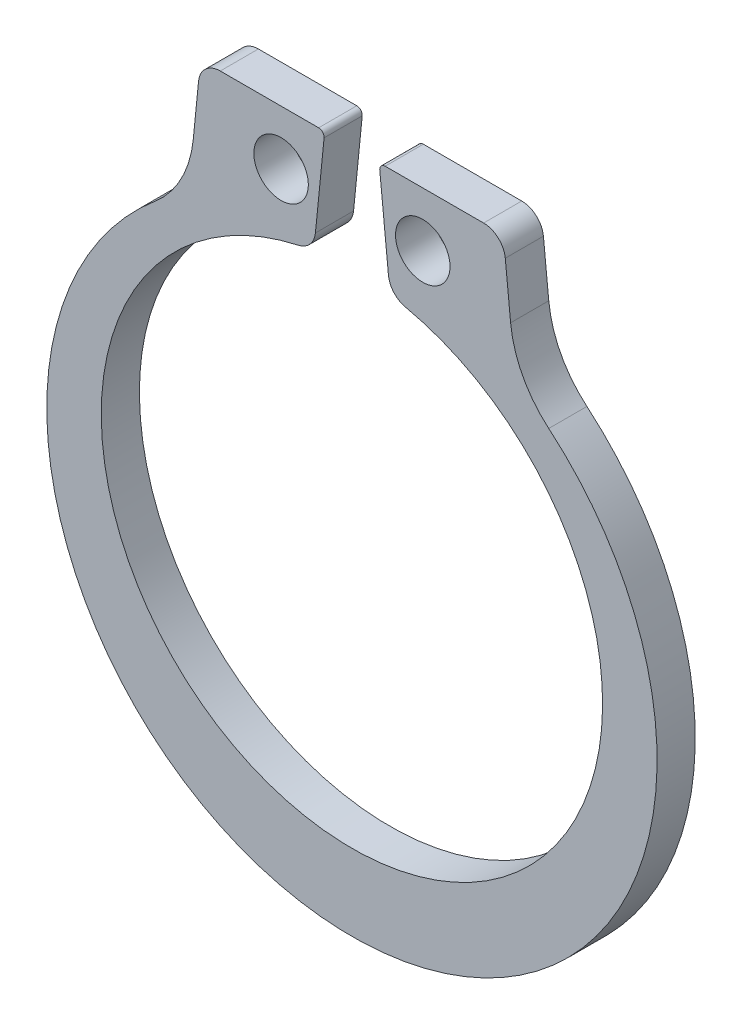
ISO-10303-21;
HEADER;
FILE_DESCRIPTION(('STEP AP214'),'2;1');
FILE_NAME('part.step','',(''),(''),'','','');
FILE_SCHEMA(('AUTOMOTIVE_DESIGN { 1 0 10303 214 1 1 1 1 }'));
ENDSEC;
DATA;
#1=APPLICATION_CONTEXT('core data for automotive mechanical design processes');
#2=APPLICATION_PROTOCOL_DEFINITION('international standard','automotive_design',2000,#1);
#3=PRODUCT_CONTEXT('',#1,'mechanical');
#4=PRODUCT('Part','Part','',(#3));
#5=PRODUCT_RELATED_PRODUCT_CATEGORY('part','',(#4));
#6=PRODUCT_DEFINITION_FORMATION('','',#4);
#7=PRODUCT_DEFINITION_CONTEXT('part definition',#1,'design');
#8=PRODUCT_DEFINITION('design','',#6,#7);
#9=PRODUCT_DEFINITION_SHAPE('','',#8);
#10=(LENGTH_UNIT() NAMED_UNIT(*) SI_UNIT(.MILLI.,.METRE.));
#11=(NAMED_UNIT(*) PLANE_ANGLE_UNIT() SI_UNIT($,.RADIAN.));
#12=(NAMED_UNIT(*) SI_UNIT($,.STERADIAN.) SOLID_ANGLE_UNIT());
#13=UNCERTAINTY_MEASURE_WITH_UNIT(LENGTH_MEASURE(1.E-05),#10,'distance_accuracy_value','');
#14=(GEOMETRIC_REPRESENTATION_CONTEXT(3) GLOBAL_UNCERTAINTY_ASSIGNED_CONTEXT((#13)) GLOBAL_UNIT_ASSIGNED_CONTEXT((#10,
#11,#12)) REPRESENTATION_CONTEXT('',''));
#15=CARTESIAN_POINT('',(0.,0.,0.));
#16=DIRECTION('',(0.,0.,1.));
#17=DIRECTION('',(1.,0.,0.));
#18=AXIS2_PLACEMENT_3D('',#15,#16,#17);
#19=CARTESIAN_POINT('',(6.22562320773473,6.86781993240851,0.889));
#20=DIRECTION('',(0.,0.,-1.));
#21=DIRECTION('',(-1.,0.,0.));
#22=AXIS2_PLACEMENT_3D('',#19,#20,#21);
#23=PLANE('',#22);
#24=CARTESIAN_POINT('',(6.22562320773473,6.86781993240851,0.889));
#25=DIRECTION('',(0.,0.,-1.));
#26=DIRECTION('',(-1.,0.,0.));
#27=AXIS2_PLACEMENT_3D('',#24,#25,#26);
#28=CIRCLE('',#27,2.54);
#29=CARTESIAN_POINT('',(4.58730131096243,4.92681468703785,0.889));
#30=VERTEX_POINT('',#29);
#31=CARTESIAN_POINT('',(3.69822874460136,6.61508048609518,0.889));
#32=VERTEX_POINT('',#31);
#33=EDGE_CURVE('E208',#30,#32,#28,.T.);
#34=ORIENTED_EDGE('',*,*,#33,.T.);
#35=DIRECTION('',(-0.0995037190209991,0.995037190209989,0.));
#36=VECTOR('',#35,1.);
#37=CARTESIAN_POINT('',(3.69822874460136,6.61508048609518,0.889));
#38=LINE('',#37,#36);
#39=CARTESIAN_POINT('',(3.57408575386381,7.85651039347067,0.889));
#40=VERTEX_POINT('',#39);
#41=EDGE_CURVE('E116',#32,#40,#38,.T.);
#42=ORIENTED_EDGE('',*,*,#41,.T.);
#43=CARTESIAN_POINT('',(3.06860686123713,7.80596250420801,0.889));
#44=DIRECTION('',(0.,0.,1.));
#45=DIRECTION('',(-1.,0.,0.));
#46=AXIS2_PLACEMENT_3D('',#43,#44,#45);
#47=CIRCLE('',#46,0.508);
#48=CARTESIAN_POINT('',(3.06860686123713,8.31396250420801,0.889));
#49=VERTEX_POINT('',#48);
#50=EDGE_CURVE('E247',#40,#49,#47,.T.);
#51=ORIENTED_EDGE('',*,*,#50,.T.);
#52=DIRECTION('',(-1.,0.,0.));
#53=VECTOR('',#52,1.);
#54=CARTESIAN_POINT('',(3.06860686123713,8.31396250420801,0.889));
#55=LINE('',#54,#53);
#56=CARTESIAN_POINT('',(0.775333420388236,8.31396250420801,0.889));
#57=VERTEX_POINT('',#56);
#58=EDGE_CURVE('E266',#49,#57,#55,.T.);
#59=ORIENTED_EDGE('',*,*,#58,.T.);
#60=CARTESIAN_POINT('',(0.775333420388235,8.18696250420801,0.889));
#61=DIRECTION('',(0.,0.,1.));
#62=DIRECTION('',(1.,0.,0.));
#63=AXIS2_PLACEMENT_3D('',#60,#61,#62);
#64=CIRCLE('',#63,0.127);
#65=CARTESIAN_POINT('',(0.648963697231567,8.17432553189234,0.889));
#66=VERTEX_POINT('',#65);
#67=EDGE_CURVE('E263',#57,#66,#64,.T.);
#68=ORIENTED_EDGE('',*,*,#67,.T.);
#69=DIRECTION('',(0.0995037190209989,-0.995037190209989,0.));
#70=VECTOR('',#69,1.);
#71=CARTESIAN_POINT('',(0.648963697231567,8.17432553189234,0.889));
#72=LINE('',#71,#70);
#73=CARTESIAN_POINT('',(0.851111103650512,6.15285146770289,0.889));
#74=VERTEX_POINT('',#73);
#75=EDGE_CURVE('E265',#66,#74,#72,.T.);
#76=ORIENTED_EDGE('',*,*,#75,.T.);
#77=CARTESIAN_POINT('',(1.35658999627719,6.20339935696556,0.889));
#78=DIRECTION('',(0.,0.,1.));
#79=DIRECTION('',(1.,0.,0.));
#80=AXIS2_PLACEMENT_3D('',#77,#78,#79);
#81=CIRCLE('',#80,0.508);
#82=CARTESIAN_POINT('',(1.24806279657501,5.70712740840831,0.889));
#83=VERTEX_POINT('',#82);
#84=EDGE_CURVE('E268',#74,#83,#81,.T.);
#85=ORIENTED_EDGE('',*,*,#84,.T.);
#86=CARTESIAN_POINT('',(0.,0.,0.889));
#87=DIRECTION('',(0.,0.,-1.));
#88=DIRECTION('',(1.,0.,0.));
#89=AXIS2_PLACEMENT_3D('',#86,#87,#88);
#90=CIRCLE('',#89,5.842);
#91=CARTESIAN_POINT('',(-1.24806279657501,5.70712740840831,0.889));
#92=VERTEX_POINT('',#91);
#93=EDGE_CURVE('E274',#83,#92,#90,.T.);
#94=ORIENTED_EDGE('',*,*,#93,.T.);
#95=CARTESIAN_POINT('',(-1.35658999627719,6.20339935696556,0.889));
#96=DIRECTION('',(0.,0.,1.));
#97=DIRECTION('',(-1.,0.,0.));
#98=AXIS2_PLACEMENT_3D('',#95,#96,#97);
#99=CIRCLE('',#98,0.508);
#100=CARTESIAN_POINT('',(-0.851111103650512,6.15285146770289,0.889));
#101=VERTEX_POINT('',#100);
#102=EDGE_CURVE('E276',#92,#101,#99,.T.);
#103=ORIENTED_EDGE('',*,*,#102,.T.);
#104=DIRECTION('',(0.0995037190209989,0.995037190209989,0.));
#105=VECTOR('',#104,1.);
#106=CARTESIAN_POINT('',(-0.648963697231567,8.17432553189234,0.889));
#107=LINE('',#106,#105);
#108=CARTESIAN_POINT('',(-0.648963697231567,8.17432553189234,0.889));
#109=VERTEX_POINT('',#108);
#110=EDGE_CURVE('E278',#101,#109,#107,.T.);
#111=ORIENTED_EDGE('',*,*,#110,.T.);
#112=CARTESIAN_POINT('',(-0.775333420388235,8.18696250420801,0.889));
#113=DIRECTION('',(0.,0.,1.));
#114=DIRECTION('',(-1.,0.,0.));
#115=AXIS2_PLACEMENT_3D('',#112,#113,#114);
#116=CIRCLE('',#115,0.127);
#117=CARTESIAN_POINT('',(-0.775333420388236,8.31396250420801,0.889));
#118=VERTEX_POINT('',#117);
#119=EDGE_CURVE('E280',#109,#118,#116,.T.);
#120=ORIENTED_EDGE('',*,*,#119,.T.);
#121=DIRECTION('',(-1.,0.,0.));
#122=VECTOR('',#121,1.);
#123=CARTESIAN_POINT('',(-3.06860686123713,8.31396250420801,0.889));
#124=LINE('',#123,#122);
#125=CARTESIAN_POINT('',(-3.06860686123713,8.31396250420801,0.889));
#126=VERTEX_POINT('',#125);
#127=EDGE_CURVE('E282',#118,#126,#124,.T.);
#128=ORIENTED_EDGE('',*,*,#127,.T.);
#129=CARTESIAN_POINT('',(-3.06860686123713,7.80596250420801,0.889));
#130=DIRECTION('',(0.,0.,1.));
#131=DIRECTION('',(1.,0.,0.));
#132=AXIS2_PLACEMENT_3D('',#129,#130,#131);
#133=CIRCLE('',#132,0.508);
#134=CARTESIAN_POINT('',(-3.57408575386381,7.85651039347067,0.889));
#135=VERTEX_POINT('',#134);
#136=EDGE_CURVE('E159',#126,#135,#133,.T.);
#137=ORIENTED_EDGE('',*,*,#136,.T.);
#138=DIRECTION('',(-0.0995037190209988,-0.995037190209989,0.));
#139=VECTOR('',#138,1.);
#140=CARTESIAN_POINT('',(-3.69822874460136,6.61508048609518,0.889));
#141=LINE('',#140,#139);
#142=CARTESIAN_POINT('',(-3.69822874460136,6.61508048609518,0.889));
#143=VERTEX_POINT('',#142);
#144=EDGE_CURVE('E153',#135,#143,#141,.T.);
#145=ORIENTED_EDGE('',*,*,#144,.T.);
#146=CARTESIAN_POINT('',(-6.22562320773473,6.86781993240851,0.889));
#147=DIRECTION('',(0.,0.,-1.));
#148=DIRECTION('',(1.,0.,0.));
#149=AXIS2_PLACEMENT_3D('',#146,#147,#148);
#150=CIRCLE('',#149,2.54);
#151=CARTESIAN_POINT('',(-4.58730131096243,4.92681468703785,0.889));
#152=VERTEX_POINT('',#151);
#153=EDGE_CURVE('E157',#143,#152,#150,.T.);
#154=ORIENTED_EDGE('',*,*,#153,.T.);
#155=CARTESIAN_POINT('',(0.,-0.508,0.889));
#156=DIRECTION('',(0.,0.,1.));
#157=DIRECTION('',(1.,0.,0.));
#158=AXIS2_PLACEMENT_3D('',#155,#156,#157);
#159=CIRCLE('',#158,7.112);
#160=EDGE_CURVE('E49',#152,#30,#159,.T.);
#161=ORIENTED_EDGE('',*,*,#160,.T.);
#162=EDGE_LOOP('',(#34,#42,#51,#59,#68,#76,#85,#94,#103,#111,#120,#128,#137,#145,#154,#161));
#163=FACE_BOUND('',#162,.T.);
#164=CARTESIAN_POINT('',(-1.651,7.04396250420801,0.889));
#165=DIRECTION('',(0.,0.,1.));
#166=DIRECTION('',(1.,0.,0.));
#167=AXIS2_PLACEMENT_3D('',#164,#165,#166);
#168=CIRCLE('',#167,0.635);
#169=CARTESIAN_POINT('',(-1.016,7.04396250420801,0.889));
#170=VERTEX_POINT('',#169);
#171=EDGE_CURVE('E181',#170,#170,#168,.T.);
#172=ORIENTED_EDGE('',*,*,#171,.F.);
#173=EDGE_LOOP('',(#172));
#174=FACE_BOUND('',#173,.T.);
#175=CARTESIAN_POINT('',(1.651,7.04396250420801,0.889));
#176=DIRECTION('',(0.,0.,1.));
#177=DIRECTION('',(1.,0.,0.));
#178=AXIS2_PLACEMENT_3D('',#175,#176,#177);
#179=CIRCLE('',#178,0.635);
#180=CARTESIAN_POINT('',(2.286,7.04396250420801,0.889));
#181=VERTEX_POINT('',#180);
#182=EDGE_CURVE('E323',#181,#181,#179,.T.);
#183=ORIENTED_EDGE('',*,*,#182,.F.);
#184=EDGE_LOOP('',(#183));
#185=FACE_BOUND('',#184,.T.);
#186=ADVANCED_FACE('F32',(#163,#174,#185),#23,.F.);
#187=CARTESIAN_POINT('',(6.22562320773473,6.86781993240851,0.));
#188=DIRECTION('',(0.,0.,-1.));
#189=DIRECTION('',(-1.,0.,0.));
#190=AXIS2_PLACEMENT_3D('',#187,#188,#189);
#191=PLANE('',#190);
#192=CARTESIAN_POINT('',(-1.651,7.04396250420801,0.));
#193=DIRECTION('',(0.,0.,1.));
#194=DIRECTION('',(1.,0.,0.));
#195=AXIS2_PLACEMENT_3D('',#192,#193,#194);
#196=CIRCLE('',#195,0.635);
#197=CARTESIAN_POINT('',(-1.016,7.04396250420801,0.));
#198=VERTEX_POINT('',#197);
#199=EDGE_CURVE('E328',#198,#198,#196,.T.);
#200=ORIENTED_EDGE('',*,*,#199,.T.);
#201=EDGE_LOOP('',(#200));
#202=FACE_BOUND('',#201,.T.);
#203=CARTESIAN_POINT('',(6.22562320773473,6.86781993240851,0.));
#204=DIRECTION('',(0.,0.,-1.));
#205=DIRECTION('',(-1.,0.,0.));
#206=AXIS2_PLACEMENT_3D('',#203,#204,#205);
#207=CIRCLE('',#206,2.54);
#208=CARTESIAN_POINT('',(4.58730131096243,4.92681468703785,0.));
#209=VERTEX_POINT('',#208);
#210=CARTESIAN_POINT('',(3.69822874460136,6.61508048609518,0.));
#211=VERTEX_POINT('',#210);
#212=EDGE_CURVE('E177',#209,#211,#207,.T.);
#213=ORIENTED_EDGE('',*,*,#212,.F.);
#214=CARTESIAN_POINT('',(0.,-0.508,0.));
#215=DIRECTION('',(0.,0.,1.));
#216=DIRECTION('',(1.,0.,0.));
#217=AXIS2_PLACEMENT_3D('',#214,#215,#216);
#218=CIRCLE('',#217,7.112);
#219=CARTESIAN_POINT('',(-4.58730131096243,4.92681468703785,0.));
#220=VERTEX_POINT('',#219);
#221=EDGE_CURVE('E108',#220,#209,#218,.T.);
#222=ORIENTED_EDGE('',*,*,#221,.F.);
#223=CARTESIAN_POINT('',(-6.22562320773473,6.86781993240851,0.));
#224=DIRECTION('',(0.,0.,-1.));
#225=DIRECTION('',(1.,0.,0.));
#226=AXIS2_PLACEMENT_3D('',#223,#224,#225);
#227=CIRCLE('',#226,2.54);
#228=CARTESIAN_POINT('',(-3.69822874460136,6.61508048609518,0.));
#229=VERTEX_POINT('',#228);
#230=EDGE_CURVE('E102',#229,#220,#227,.T.);
#231=ORIENTED_EDGE('',*,*,#230,.F.);
#232=DIRECTION('',(-0.0995037190209988,-0.995037190209989,0.));
#233=VECTOR('',#232,1.);
#234=CARTESIAN_POINT('',(-3.69822874460136,6.61508048609518,0.));
#235=LINE('',#234,#233);
#236=CARTESIAN_POINT('',(-3.57408575386381,7.85651039347067,0.));
#237=VERTEX_POINT('',#236);
#238=EDGE_CURVE('E167',#237,#229,#235,.T.);
#239=ORIENTED_EDGE('',*,*,#238,.F.);
#240=CARTESIAN_POINT('',(-3.06860686123713,7.80596250420801,0.));
#241=DIRECTION('',(0.,0.,1.));
#242=DIRECTION('',(1.,0.,0.));
#243=AXIS2_PLACEMENT_3D('',#240,#241,#242);
#244=CIRCLE('',#243,0.508);
#245=CARTESIAN_POINT('',(-3.06860686123713,8.31396250420801,0.));
#246=VERTEX_POINT('',#245);
#247=EDGE_CURVE('E203',#246,#237,#244,.T.);
#248=ORIENTED_EDGE('',*,*,#247,.F.);
#249=DIRECTION('',(-1.,0.,0.));
#250=VECTOR('',#249,1.);
#251=CARTESIAN_POINT('',(-3.06860686123713,8.31396250420801,0.));
#252=LINE('',#251,#250);
#253=CARTESIAN_POINT('',(-0.775333420388236,8.31396250420801,0.));
#254=VERTEX_POINT('',#253);
#255=EDGE_CURVE('E201',#254,#246,#252,.T.);
#256=ORIENTED_EDGE('',*,*,#255,.F.);
#257=CARTESIAN_POINT('',(-0.775333420388235,8.18696250420801,0.));
#258=DIRECTION('',(0.,0.,1.));
#259=DIRECTION('',(-1.,0.,0.));
#260=AXIS2_PLACEMENT_3D('',#257,#258,#259);
#261=CIRCLE('',#260,0.127);
#262=CARTESIAN_POINT('',(-0.648963697231567,8.17432553189234,0.));
#263=VERTEX_POINT('',#262);
#264=EDGE_CURVE('E199',#263,#254,#261,.T.);
#265=ORIENTED_EDGE('',*,*,#264,.F.);
#266=DIRECTION('',(0.0995037190209989,0.995037190209989,0.));
#267=VECTOR('',#266,1.);
#268=CARTESIAN_POINT('',(-0.648963697231567,8.17432553189234,0.));
#269=LINE('',#268,#267);
#270=CARTESIAN_POINT('',(-0.851111103650512,6.15285146770289,0.));
#271=VERTEX_POINT('',#270);
#272=EDGE_CURVE('E197',#271,#263,#269,.T.);
#273=ORIENTED_EDGE('',*,*,#272,.F.);
#274=CARTESIAN_POINT('',(-1.35658999627719,6.20339935696556,0.));
#275=DIRECTION('',(0.,0.,1.));
#276=DIRECTION('',(-1.,0.,0.));
#277=AXIS2_PLACEMENT_3D('',#274,#275,#276);
#278=CIRCLE('',#277,0.508);
#279=CARTESIAN_POINT('',(-1.24806279657501,5.70712740840831,0.));
#280=VERTEX_POINT('',#279);
#281=EDGE_CURVE('E195',#280,#271,#278,.T.);
#282=ORIENTED_EDGE('',*,*,#281,.F.);
#283=CARTESIAN_POINT('',(0.,0.,0.));
#284=DIRECTION('',(0.,0.,-1.));
#285=DIRECTION('',(1.,0.,0.));
#286=AXIS2_PLACEMENT_3D('',#283,#284,#285);
#287=CIRCLE('',#286,5.842);
#288=CARTESIAN_POINT('',(1.24806279657501,5.70712740840831,0.));
#289=VERTEX_POINT('',#288);
#290=EDGE_CURVE('E193',#289,#280,#287,.T.);
#291=ORIENTED_EDGE('',*,*,#290,.F.);
#292=CARTESIAN_POINT('',(1.35658999627719,6.20339935696556,0.));
#293=DIRECTION('',(0.,0.,1.));
#294=DIRECTION('',(1.,0.,0.));
#295=AXIS2_PLACEMENT_3D('',#292,#293,#294);
#296=CIRCLE('',#295,0.508);
#297=CARTESIAN_POINT('',(0.851111103650512,6.15285146770289,0.));
#298=VERTEX_POINT('',#297);
#299=EDGE_CURVE('E191',#298,#289,#296,.T.);
#300=ORIENTED_EDGE('',*,*,#299,.F.);
#301=DIRECTION('',(0.0995037190209989,-0.995037190209989,0.));
#302=VECTOR('',#301,1.);
#303=CARTESIAN_POINT('',(0.648963697231567,8.17432553189234,0.));
#304=LINE('',#303,#302);
#305=CARTESIAN_POINT('',(0.648963697231567,8.17432553189234,0.));
#306=VERTEX_POINT('',#305);
#307=EDGE_CURVE('E189',#306,#298,#304,.T.);
#308=ORIENTED_EDGE('',*,*,#307,.F.);
#309=CARTESIAN_POINT('',(0.775333420388235,8.18696250420801,0.));
#310=DIRECTION('',(0.,0.,1.));
#311=DIRECTION('',(1.,0.,0.));
#312=AXIS2_PLACEMENT_3D('',#309,#310,#311);
#313=CIRCLE('',#312,0.127);
#314=CARTESIAN_POINT('',(0.775333420388236,8.31396250420801,0.));
#315=VERTEX_POINT('',#314);
#316=EDGE_CURVE('E187',#315,#306,#313,.T.);
#317=ORIENTED_EDGE('',*,*,#316,.F.);
#318=DIRECTION('',(-1.,0.,0.));
#319=VECTOR('',#318,1.);
#320=CARTESIAN_POINT('',(3.06860686123713,8.31396250420801,0.));
#321=LINE('',#320,#319);
#322=CARTESIAN_POINT('',(3.06860686123713,8.31396250420801,0.));
#323=VERTEX_POINT('',#322);
#324=EDGE_CURVE('E185',#323,#315,#321,.T.);
#325=ORIENTED_EDGE('',*,*,#324,.F.);
#326=CARTESIAN_POINT('',(3.06860686123713,7.80596250420801,0.));
#327=DIRECTION('',(0.,0.,1.));
#328=DIRECTION('',(-1.,0.,0.));
#329=AXIS2_PLACEMENT_3D('',#326,#327,#328);
#330=CIRCLE('',#329,0.508);
#331=CARTESIAN_POINT('',(3.57408575386381,7.85651039347067,0.));
#332=VERTEX_POINT('',#331);
#333=EDGE_CURVE('E183',#332,#323,#330,.T.);
#334=ORIENTED_EDGE('',*,*,#333,.F.);
#335=DIRECTION('',(-0.0995037190209991,0.995037190209989,0.));
#336=VECTOR('',#335,1.);
#337=CARTESIAN_POINT('',(3.69822874460136,6.61508048609518,0.));
#338=LINE('',#337,#336);
#339=EDGE_CURVE('E180',#211,#332,#338,.T.);
#340=ORIENTED_EDGE('',*,*,#339,.F.);
#341=EDGE_LOOP('',(#213,#222,#231,#239,#248,#256,#265,#273,#282,#291,#300,#308,#317,#325,#334,#340));
#342=FACE_BOUND('',#341,.T.);
#343=CARTESIAN_POINT('',(1.651,7.04396250420801,0.));
#344=DIRECTION('',(0.,0.,1.));
#345=DIRECTION('',(1.,0.,0.));
#346=AXIS2_PLACEMENT_3D('',#343,#344,#345);
#347=CIRCLE('',#346,0.635);
#348=CARTESIAN_POINT('',(2.286,7.04396250420801,0.));
#349=VERTEX_POINT('',#348);
#350=EDGE_CURVE('E326',#349,#349,#347,.T.);
#351=ORIENTED_EDGE('',*,*,#350,.T.);
#352=EDGE_LOOP('',(#351));
#353=FACE_BOUND('',#352,.T.);
#354=ADVANCED_FACE('F251',(#202,#342,#353),#191,.T.);
#355=CARTESIAN_POINT('',(6.22562320773473,6.86781993240851,0.889));
#356=DIRECTION('',(0.,0.,-1.));
#357=DIRECTION('',(-1.,0.,0.));
#358=AXIS2_PLACEMENT_3D('',#355,#356,#357);
#359=CYLINDRICAL_SURFACE('',#358,2.54);
#360=ORIENTED_EDGE('',*,*,#212,.T.);
#361=DIRECTION('',(0.,0.,-1.));
#362=VECTOR('',#361,1.);
#363=CARTESIAN_POINT('',(3.69822874460136,6.61508048609518,0.889));
#364=LINE('',#363,#362);
#365=EDGE_CURVE('E11',#32,#211,#364,.T.);
#366=ORIENTED_EDGE('',*,*,#365,.F.);
#367=ORIENTED_EDGE('',*,*,#33,.F.);
#368=DIRECTION('',(0.,0.,-1.));
#369=VECTOR('',#368,1.);
#370=CARTESIAN_POINT('',(4.58730131096243,4.92681468703785,0.889));
#371=LINE('',#370,#369);
#372=EDGE_CURVE('E173',#30,#209,#371,.T.);
#373=ORIENTED_EDGE('',*,*,#372,.T.);
#374=EDGE_LOOP('',(#360,#366,#367,#373));
#375=FACE_BOUND('',#374,.T.);
#376=ADVANCED_FACE('F34',(#375),#359,.F.);
#377=CARTESIAN_POINT('',(3.69822874460136,6.61508048609518,0.889));
#378=DIRECTION('',(-0.995037190209989,-0.0995037190209991,0.));
#379=DIRECTION('',(0.0995037190209991,-0.995037190209989,0.));
#380=AXIS2_PLACEMENT_3D('',#377,#378,#379);
#381=PLANE('',#380);
#382=ORIENTED_EDGE('',*,*,#339,.T.);
#383=DIRECTION('',(0.,0.,-1.));
#384=VECTOR('',#383,1.);
#385=CARTESIAN_POINT('',(3.57408575386381,7.85651039347067,0.889));
#386=LINE('',#385,#384);
#387=EDGE_CURVE('E41',#40,#332,#386,.T.);
#388=ORIENTED_EDGE('',*,*,#387,.F.);
#389=ORIENTED_EDGE('',*,*,#41,.F.);
#390=ORIENTED_EDGE('',*,*,#365,.T.);
#391=EDGE_LOOP('',(#382,#388,#389,#390));
#392=FACE_BOUND('',#391,.T.);
#393=ADVANCED_FACE('F463',(#392),#381,.F.);
#394=CARTESIAN_POINT('',(3.06860686123713,7.80596250420801,0.889));
#395=DIRECTION('',(0.,0.,-1.));
#396=DIRECTION('',(-1.,0.,0.));
#397=AXIS2_PLACEMENT_3D('',#394,#395,#396);
#398=CYLINDRICAL_SURFACE('',#397,0.508);
#399=ORIENTED_EDGE('',*,*,#333,.T.);
#400=DIRECTION('',(0.,0.,-1.));
#401=VECTOR('',#400,1.);
#402=CARTESIAN_POINT('',(3.06860686123713,8.31396250420801,0.889));
#403=LINE('',#402,#401);
#404=EDGE_CURVE('E239',#49,#323,#403,.T.);
#405=ORIENTED_EDGE('',*,*,#404,.F.);
#406=ORIENTED_EDGE('',*,*,#50,.F.);
#407=ORIENTED_EDGE('',*,*,#387,.T.);
#408=EDGE_LOOP('',(#399,#405,#406,#407));
#409=FACE_BOUND('',#408,.T.);
#410=ADVANCED_FACE('F245',(#409),#398,.T.);
#411=CARTESIAN_POINT('',(3.06860686123713,8.31396250420801,0.889));
#412=DIRECTION('',(0.,-1.,0.));
#413=DIRECTION('',(0.,0.,-1.));
#414=AXIS2_PLACEMENT_3D('',#411,#412,#413);
#415=PLANE('',#414);
#416=ORIENTED_EDGE('',*,*,#324,.T.);
#417=DIRECTION('',(0.,0.,-1.));
#418=VECTOR('',#417,1.);
#419=CARTESIAN_POINT('',(0.775333420388236,8.31396250420801,0.889));
#420=LINE('',#419,#418);
#421=EDGE_CURVE('E236',#57,#315,#420,.T.);
#422=ORIENTED_EDGE('',*,*,#421,.F.);
#423=ORIENTED_EDGE('',*,*,#58,.F.);
#424=ORIENTED_EDGE('',*,*,#404,.T.);
#425=EDGE_LOOP('',(#416,#422,#423,#424));
#426=FACE_BOUND('',#425,.T.);
#427=ADVANCED_FACE('F257',(#426),#415,.F.);
#428=CARTESIAN_POINT('',(0.775333420388235,8.18696250420801,0.889));
#429=DIRECTION('',(0.,0.,-1.));
#430=DIRECTION('',(-1.,0.,0.));
#431=AXIS2_PLACEMENT_3D('',#428,#429,#430);
#432=CYLINDRICAL_SURFACE('',#431,0.127);
#433=ORIENTED_EDGE('',*,*,#316,.T.);
#434=DIRECTION('',(0.,0.,-1.));
#435=VECTOR('',#434,1.);
#436=CARTESIAN_POINT('',(0.648963697231567,8.17432553189234,0.889));
#437=LINE('',#436,#435);
#438=EDGE_CURVE('E233',#66,#306,#437,.T.);
#439=ORIENTED_EDGE('',*,*,#438,.F.);
#440=ORIENTED_EDGE('',*,*,#67,.F.);
#441=ORIENTED_EDGE('',*,*,#421,.T.);
#442=EDGE_LOOP('',(#433,#439,#440,#441));
#443=FACE_BOUND('',#442,.T.);
#444=ADVANCED_FACE('F261',(#443),#432,.T.);
#445=CARTESIAN_POINT('',(0.648963697231567,8.17432553189234,0.889));
#446=DIRECTION('',(0.995037190209989,0.0995037190209989,0.));
#447=DIRECTION('',(-0.0995037190209989,0.995037190209989,0.));
#448=AXIS2_PLACEMENT_3D('',#445,#446,#447);
#449=PLANE('',#448);
#450=ORIENTED_EDGE('',*,*,#307,.T.);
#451=DIRECTION('',(0.,0.,-1.));
#452=VECTOR('',#451,1.);
#453=CARTESIAN_POINT('',(0.851111103650512,6.15285146770289,0.889));
#454=LINE('',#453,#452);
#455=EDGE_CURVE('E230',#74,#298,#454,.T.);
#456=ORIENTED_EDGE('',*,*,#455,.F.);
#457=ORIENTED_EDGE('',*,*,#75,.F.);
#458=ORIENTED_EDGE('',*,*,#438,.T.);
#459=EDGE_LOOP('',(#450,#456,#457,#458));
#460=FACE_BOUND('',#459,.T.);
#461=ADVANCED_FACE('F428',(#460),#449,.F.);
#462=CARTESIAN_POINT('',(1.35658999627719,6.20339935696556,0.889));
#463=DIRECTION('',(0.,0.,-1.));
#464=DIRECTION('',(-1.,0.,0.));
#465=AXIS2_PLACEMENT_3D('',#462,#463,#464);
#466=CYLINDRICAL_SURFACE('',#465,0.508);
#467=ORIENTED_EDGE('',*,*,#299,.T.);
#468=DIRECTION('',(0.,0.,-1.));
#469=VECTOR('',#468,1.);
#470=CARTESIAN_POINT('',(1.24806279657501,5.70712740840831,0.889));
#471=LINE('',#470,#469);
#472=EDGE_CURVE('E227',#83,#289,#471,.T.);
#473=ORIENTED_EDGE('',*,*,#472,.F.);
#474=ORIENTED_EDGE('',*,*,#84,.F.);
#475=ORIENTED_EDGE('',*,*,#455,.T.);
#476=EDGE_LOOP('',(#467,#473,#474,#475));
#477=FACE_BOUND('',#476,.T.);
#478=ADVANCED_FACE('F418',(#477),#466,.T.);
#479=CARTESIAN_POINT('',(0.,0.,0.889));
#480=DIRECTION('',(0.,0.,-1.));
#481=DIRECTION('',(-1.,0.,0.));
#482=AXIS2_PLACEMENT_3D('',#479,#480,#481);
#483=CYLINDRICAL_SURFACE('',#482,5.842);
#484=ORIENTED_EDGE('',*,*,#290,.T.);
#485=DIRECTION('',(0.,0.,-1.));
#486=VECTOR('',#485,1.);
#487=CARTESIAN_POINT('',(-1.24806279657501,5.70712740840831,0.889));
#488=LINE('',#487,#486);
#489=EDGE_CURVE('E224',#92,#280,#488,.T.);
#490=ORIENTED_EDGE('',*,*,#489,.F.);
#491=ORIENTED_EDGE('',*,*,#93,.F.);
#492=ORIENTED_EDGE('',*,*,#472,.T.);
#493=EDGE_LOOP('',(#484,#490,#491,#492));
#494=FACE_BOUND('',#493,.T.);
#495=ADVANCED_FACE('F408',(#494),#483,.F.);
#496=CARTESIAN_POINT('',(-1.35658999627719,6.20339935696556,0.889));
#497=DIRECTION('',(0.,0.,-1.));
#498=DIRECTION('',(-1.,0.,0.));
#499=AXIS2_PLACEMENT_3D('',#496,#497,#498);
#500=CYLINDRICAL_SURFACE('',#499,0.508);
#501=ORIENTED_EDGE('',*,*,#281,.T.);
#502=DIRECTION('',(0.,0.,-1.));
#503=VECTOR('',#502,1.);
#504=CARTESIAN_POINT('',(-0.851111103650512,6.15285146770289,0.889));
#505=LINE('',#504,#503);
#506=EDGE_CURVE('E221',#101,#271,#505,.T.);
#507=ORIENTED_EDGE('',*,*,#506,.F.);
#508=ORIENTED_EDGE('',*,*,#102,.F.);
#509=ORIENTED_EDGE('',*,*,#489,.T.);
#510=EDGE_LOOP('',(#501,#507,#508,#509));
#511=FACE_BOUND('',#510,.T.);
#512=ADVANCED_FACE('F398',(#511),#500,.T.);
#513=CARTESIAN_POINT('',(-0.648963697231567,8.17432553189234,0.889));
#514=DIRECTION('',(-0.995037190209989,0.0995037190209989,0.));
#515=DIRECTION('',(-0.0995037190209989,-0.995037190209989,0.));
#516=AXIS2_PLACEMENT_3D('',#513,#514,#515);
#517=PLANE('',#516);
#518=ORIENTED_EDGE('',*,*,#272,.T.);
#519=DIRECTION('',(0.,0.,-1.));
#520=VECTOR('',#519,1.);
#521=CARTESIAN_POINT('',(-0.648963697231567,8.17432553189234,0.889));
#522=LINE('',#521,#520);
#523=EDGE_CURVE('E218',#109,#263,#522,.T.);
#524=ORIENTED_EDGE('',*,*,#523,.F.);
#525=ORIENTED_EDGE('',*,*,#110,.F.);
#526=ORIENTED_EDGE('',*,*,#506,.T.);
#527=EDGE_LOOP('',(#518,#524,#525,#526));
#528=FACE_BOUND('',#527,.T.);
#529=ADVANCED_FACE('F388',(#528),#517,.F.);
#530=CARTESIAN_POINT('',(-0.775333420388235,8.18696250420801,0.889));
#531=DIRECTION('',(0.,0.,-1.));
#532=DIRECTION('',(-1.,0.,0.));
#533=AXIS2_PLACEMENT_3D('',#530,#531,#532);
#534=CYLINDRICAL_SURFACE('',#533,0.127);
#535=ORIENTED_EDGE('',*,*,#264,.T.);
#536=DIRECTION('',(0.,0.,-1.));
#537=VECTOR('',#536,1.);
#538=CARTESIAN_POINT('',(-0.775333420388236,8.31396250420801,0.889));
#539=LINE('',#538,#537);
#540=EDGE_CURVE('E215',#118,#254,#539,.T.);
#541=ORIENTED_EDGE('',*,*,#540,.F.);
#542=ORIENTED_EDGE('',*,*,#119,.F.);
#543=ORIENTED_EDGE('',*,*,#523,.T.);
#544=EDGE_LOOP('',(#535,#541,#542,#543));
#545=FACE_BOUND('',#544,.T.);
#546=ADVANCED_FACE('F379',(#545),#534,.T.);
#547=CARTESIAN_POINT('',(-3.06860686123713,8.31396250420801,0.889));
#548=DIRECTION('',(0.,-1.,0.));
#549=DIRECTION('',(0.,0.,-1.));
#550=AXIS2_PLACEMENT_3D('',#547,#548,#549);
#551=PLANE('',#550);
#552=ORIENTED_EDGE('',*,*,#255,.T.);
#553=DIRECTION('',(0.,0.,-1.));
#554=VECTOR('',#553,1.);
#555=CARTESIAN_POINT('',(-3.06860686123713,8.31396250420801,0.889));
#556=LINE('',#555,#554);
#557=EDGE_CURVE('E212',#126,#246,#556,.T.);
#558=ORIENTED_EDGE('',*,*,#557,.F.);
#559=ORIENTED_EDGE('',*,*,#127,.F.);
#560=ORIENTED_EDGE('',*,*,#540,.T.);
#561=EDGE_LOOP('',(#552,#558,#559,#560));
#562=FACE_BOUND('',#561,.T.);
#563=ADVANCED_FACE('F288',(#562),#551,.F.);
#564=CARTESIAN_POINT('',(-3.06860686123713,7.80596250420801,0.889));
#565=DIRECTION('',(0.,0.,-1.));
#566=DIRECTION('',(-1.,0.,0.));
#567=AXIS2_PLACEMENT_3D('',#564,#565,#566);
#568=CYLINDRICAL_SURFACE('',#567,0.508);
#569=ORIENTED_EDGE('',*,*,#247,.T.);
#570=DIRECTION('',(0.,0.,-1.));
#571=VECTOR('',#570,1.);
#572=CARTESIAN_POINT('',(-3.57408575386381,7.85651039347067,0.889));
#573=LINE('',#572,#571);
#574=EDGE_CURVE('E168',#135,#237,#573,.T.);
#575=ORIENTED_EDGE('',*,*,#574,.F.);
#576=ORIENTED_EDGE('',*,*,#136,.F.);
#577=ORIENTED_EDGE('',*,*,#557,.T.);
#578=EDGE_LOOP('',(#569,#575,#576,#577));
#579=FACE_BOUND('',#578,.T.);
#580=ADVANCED_FACE('F292',(#579),#568,.T.);
#581=CARTESIAN_POINT('',(-3.69822874460136,6.61508048609518,0.889));
#582=DIRECTION('',(0.995037190209989,-0.0995037190209989,0.));
#583=DIRECTION('',(0.0995037190209989,0.995037190209989,0.));
#584=AXIS2_PLACEMENT_3D('',#581,#582,#583);
#585=PLANE('',#584);
#586=ORIENTED_EDGE('',*,*,#238,.T.);
#587=DIRECTION('',(0.,0.,-1.));
#588=VECTOR('',#587,1.);
#589=CARTESIAN_POINT('',(-3.69822874460136,6.61508048609518,0.889));
#590=LINE('',#589,#588);
#591=EDGE_CURVE('E164',#143,#229,#590,.T.);
#592=ORIENTED_EDGE('',*,*,#591,.F.);
#593=ORIENTED_EDGE('',*,*,#144,.F.);
#594=ORIENTED_EDGE('',*,*,#574,.T.);
#595=EDGE_LOOP('',(#586,#592,#593,#594));
#596=FACE_BOUND('',#595,.T.);
#597=ADVANCED_FACE('F165',(#596),#585,.F.);
#598=CARTESIAN_POINT('',(-6.22562320773473,6.86781993240851,0.889));
#599=DIRECTION('',(0.,0.,-1.));
#600=DIRECTION('',(-1.,0.,0.));
#601=AXIS2_PLACEMENT_3D('',#598,#599,#600);
#602=CYLINDRICAL_SURFACE('',#601,2.54);
#603=ORIENTED_EDGE('',*,*,#230,.T.);
#604=DIRECTION('',(0.,0.,-1.));
#605=VECTOR('',#604,1.);
#606=CARTESIAN_POINT('',(-4.58730131096243,4.92681468703785,0.889));
#607=LINE('',#606,#605);
#608=EDGE_CURVE('E169',#152,#220,#607,.T.);
#609=ORIENTED_EDGE('',*,*,#608,.F.);
#610=ORIENTED_EDGE('',*,*,#153,.F.);
#611=ORIENTED_EDGE('',*,*,#591,.T.);
#612=EDGE_LOOP('',(#603,#609,#610,#611));
#613=FACE_BOUND('',#612,.T.);
#614=ADVANCED_FACE('F171',(#613),#602,.F.);
#615=CARTESIAN_POINT('',(0.,-0.508,0.889));
#616=DIRECTION('',(0.,0.,-1.));
#617=DIRECTION('',(-1.,0.,0.));
#618=AXIS2_PLACEMENT_3D('',#615,#616,#617);
#619=CYLINDRICAL_SURFACE('',#618,7.112);
#620=ORIENTED_EDGE('',*,*,#221,.T.);
#621=ORIENTED_EDGE('',*,*,#372,.F.);
#622=ORIENTED_EDGE('',*,*,#160,.F.);
#623=ORIENTED_EDGE('',*,*,#608,.T.);
#624=EDGE_LOOP('',(#620,#621,#622,#623));
#625=FACE_BOUND('',#624,.T.);
#626=ADVANCED_FACE('F296',(#625),#619,.T.);
#627=CARTESIAN_POINT('',(-1.651,7.04396250420801,0.889));
#628=DIRECTION('',(0.,0.,-1.));
#629=DIRECTION('',(-1.,0.,0.));
#630=AXIS2_PLACEMENT_3D('',#627,#628,#629);
#631=CYLINDRICAL_SURFACE('',#630,0.635);
#632=ORIENTED_EDGE('',*,*,#171,.T.);
#633=EDGE_LOOP('',(#632));
#634=FACE_BOUND('',#633,.T.);
#635=ORIENTED_EDGE('',*,*,#199,.F.);
#636=EDGE_LOOP('',(#635));
#637=FACE_BOUND('',#636,.T.);
#638=ADVANCED_FACE('F298',(#634,#637),#631,.F.);
#639=CARTESIAN_POINT('',(1.651,7.04396250420801,0.889));
#640=DIRECTION('',(0.,0.,-1.));
#641=DIRECTION('',(-1.,0.,0.));
#642=AXIS2_PLACEMENT_3D('',#639,#640,#641);
#643=CYLINDRICAL_SURFACE('',#642,0.635);
#644=ORIENTED_EDGE('',*,*,#182,.T.);
#645=EDGE_LOOP('',(#644));
#646=FACE_BOUND('',#645,.T.);
#647=ORIENTED_EDGE('',*,*,#350,.F.);
#648=EDGE_LOOP('',(#647));
#649=FACE_BOUND('',#648,.T.);
#650=ADVANCED_FACE('F304',(#646,#649),#643,.F.);
#651=CLOSED_SHELL('',(#186,#354,#376,#393,#410,#427,#444,#461,#478,#495,#512,#529,#546,#563,
#580,#597,#614,#626,#638,#650));
#652=MANIFOLD_SOLID_BREP('B2',#651);
#653=ADVANCED_BREP_SHAPE_REPRESENTATION('',(#18,#652),#14);
#654=SHAPE_DEFINITION_REPRESENTATION(#9,#653);
ENDSEC;
END-ISO-10303-21;
